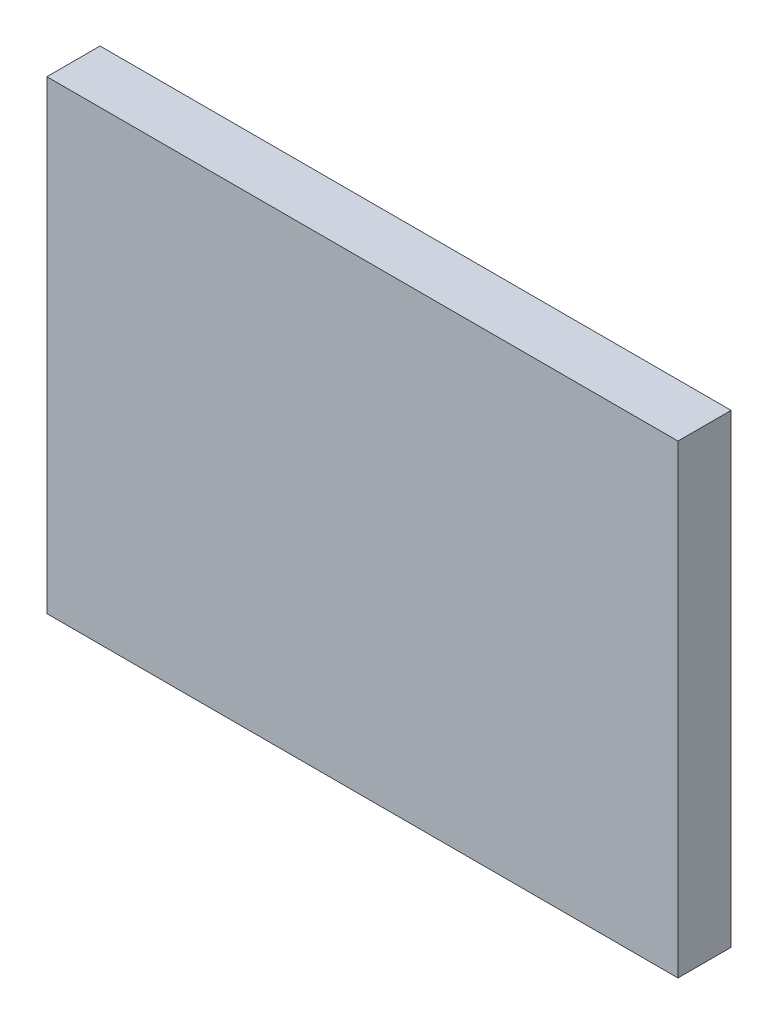
ISO-10303-21;
HEADER;
FILE_DESCRIPTION(('STEP AP214'),'2;1');
FILE_NAME('part.step','',(''),(''),'','','');
FILE_SCHEMA(('AUTOMOTIVE_DESIGN { 1 0 10303 214 1 1 1 1 }'));
ENDSEC;
DATA;
#1=APPLICATION_CONTEXT('core data for automotive mechanical design processes');
#2=APPLICATION_PROTOCOL_DEFINITION('international standard','automotive_design',2000,#1);
#3=PRODUCT_CONTEXT('',#1,'mechanical');
#4=PRODUCT('Part','Part','',(#3));
#5=PRODUCT_RELATED_PRODUCT_CATEGORY('part','',(#4));
#6=PRODUCT_DEFINITION_FORMATION('','',#4);
#7=PRODUCT_DEFINITION_CONTEXT('part definition',#1,'design');
#8=PRODUCT_DEFINITION('design','',#6,#7);
#9=PRODUCT_DEFINITION_SHAPE('','',#8);
#10=(LENGTH_UNIT() NAMED_UNIT(*) SI_UNIT(.MILLI.,.METRE.));
#11=(NAMED_UNIT(*) PLANE_ANGLE_UNIT() SI_UNIT($,.RADIAN.));
#12=(NAMED_UNIT(*) SI_UNIT($,.STERADIAN.) SOLID_ANGLE_UNIT());
#13=UNCERTAINTY_MEASURE_WITH_UNIT(LENGTH_MEASURE(1.E-05),#10,'distance_accuracy_value','');
#14=(GEOMETRIC_REPRESENTATION_CONTEXT(3) GLOBAL_UNCERTAINTY_ASSIGNED_CONTEXT((#13)) GLOBAL_UNIT_ASSIGNED_CONTEXT((#10,
#11,#12)) REPRESENTATION_CONTEXT('',''));
#15=CARTESIAN_POINT('',(0.,0.,0.));
#16=DIRECTION('',(0.,0.,1.));
#17=DIRECTION('',(1.,0.,0.));
#18=AXIS2_PLACEMENT_3D('',#15,#16,#17);
#19=CARTESIAN_POINT('',(-11.,-7.,1.6));
#20=DIRECTION('',(0.,0.,-1.));
#21=DIRECTION('',(-1.,0.,0.));
#22=AXIS2_PLACEMENT_3D('',#19,#20,#21);
#23=PLANE('',#22);
#24=DIRECTION('',(0.,1.,0.));
#25=VECTOR('',#24,1.);
#26=CARTESIAN_POINT('',(8.,-7.,1.6));
#27=LINE('',#26,#25);
#28=CARTESIAN_POINT('',(8.,-7.,1.6));
#29=VERTEX_POINT('',#28);
#30=CARTESIAN_POINT('',(8.,7.,1.6));
#31=VERTEX_POINT('',#30);
#32=EDGE_CURVE('E54',#29,#31,#27,.T.);
#33=ORIENTED_EDGE('',*,*,#32,.T.);
#34=DIRECTION('',(1.,0.,0.));
#35=VECTOR('',#34,1.);
#36=CARTESIAN_POINT('',(8.,7.,1.6));
#37=LINE('',#36,#35);
#38=CARTESIAN_POINT('',(-11.,7.,1.6));
#39=VERTEX_POINT('',#38);
#40=EDGE_CURVE('E56',#31,#39,#37,.F.);
#41=ORIENTED_EDGE('',*,*,#40,.T.);
#42=DIRECTION('',(0.,1.,0.));
#43=VECTOR('',#42,1.);
#44=CARTESIAN_POINT('',(-11.,7.,1.6));
#45=LINE('',#44,#43);
#46=CARTESIAN_POINT('',(-11.,-7.,1.6));
#47=VERTEX_POINT('',#46);
#48=EDGE_CURVE('E19',#39,#47,#45,.F.);
#49=ORIENTED_EDGE('',*,*,#48,.T.);
#50=DIRECTION('',(1.,0.,0.));
#51=VECTOR('',#50,1.);
#52=CARTESIAN_POINT('',(-11.,-7.,1.6));
#53=LINE('',#52,#51);
#54=EDGE_CURVE('E79',#47,#29,#53,.T.);
#55=ORIENTED_EDGE('',*,*,#54,.T.);
#56=EDGE_LOOP('',(#33,#41,#49,#55));
#57=FACE_BOUND('',#56,.T.);
#58=ADVANCED_FACE('F16',(#57),#23,.F.);
#59=CARTESIAN_POINT('',(-11.,7.,0.));
#60=DIRECTION('',(1.,0.,0.));
#61=DIRECTION('',(0.,0.,-1.));
#62=AXIS2_PLACEMENT_3D('',#59,#60,#61);
#63=PLANE('',#62);
#64=DIRECTION('',(0.,0.,1.));
#65=VECTOR('',#64,1.);
#66=CARTESIAN_POINT('',(-11.,-7.,0.));
#67=LINE('',#66,#65);
#68=CARTESIAN_POINT('',(-11.,-7.,0.));
#69=VERTEX_POINT('',#68);
#70=EDGE_CURVE('E67',#69,#47,#67,.T.);
#71=ORIENTED_EDGE('',*,*,#70,.T.);
#72=ORIENTED_EDGE('',*,*,#48,.F.);
#73=DIRECTION('',(0.,0.,-1.));
#74=VECTOR('',#73,1.);
#75=CARTESIAN_POINT('',(-11.,7.,0.));
#76=LINE('',#75,#74);
#77=CARTESIAN_POINT('',(-11.,7.,0.));
#78=VERTEX_POINT('',#77);
#79=EDGE_CURVE('E62',#39,#78,#76,.T.);
#80=ORIENTED_EDGE('',*,*,#79,.T.);
#81=DIRECTION('',(0.,1.,0.));
#82=VECTOR('',#81,1.);
#83=CARTESIAN_POINT('',(-11.,-7.,0.));
#84=LINE('',#83,#82);
#85=EDGE_CURVE('E82',#69,#78,#84,.T.);
#86=ORIENTED_EDGE('',*,*,#85,.F.);
#87=EDGE_LOOP('',(#71,#72,#80,#86));
#88=FACE_BOUND('',#87,.T.);
#89=ADVANCED_FACE('F64',(#88),#63,.F.);
#90=CARTESIAN_POINT('',(8.,7.,0.));
#91=DIRECTION('',(0.,-1.,0.));
#92=DIRECTION('',(0.,0.,-1.));
#93=AXIS2_PLACEMENT_3D('',#90,#91,#92);
#94=PLANE('',#93);
#95=ORIENTED_EDGE('',*,*,#79,.F.);
#96=ORIENTED_EDGE('',*,*,#40,.F.);
#97=DIRECTION('',(0.,0.,1.));
#98=VECTOR('',#97,1.);
#99=CARTESIAN_POINT('',(8.,7.,0.));
#100=LINE('',#99,#98);
#101=CARTESIAN_POINT('',(8.,7.,0.));
#102=VERTEX_POINT('',#101);
#103=EDGE_CURVE('E74',#31,#102,#100,.F.);
#104=ORIENTED_EDGE('',*,*,#103,.T.);
#105=DIRECTION('',(-1.,0.,0.));
#106=VECTOR('',#105,1.);
#107=CARTESIAN_POINT('',(-11.,7.,0.));
#108=LINE('',#107,#106);
#109=EDGE_CURVE('E71',#78,#102,#108,.F.);
#110=ORIENTED_EDGE('',*,*,#109,.F.);
#111=EDGE_LOOP('',(#95,#96,#104,#110));
#112=FACE_BOUND('',#111,.T.);
#113=ADVANCED_FACE('F69',(#112),#94,.F.);
#114=CARTESIAN_POINT('',(8.,-7.,0.));
#115=DIRECTION('',(-1.,0.,0.));
#116=DIRECTION('',(0.,0.,1.));
#117=AXIS2_PLACEMENT_3D('',#114,#115,#116);
#118=PLANE('',#117);
#119=ORIENTED_EDGE('',*,*,#103,.F.);
#120=ORIENTED_EDGE('',*,*,#32,.F.);
#121=DIRECTION('',(0.,0.,1.));
#122=VECTOR('',#121,1.);
#123=CARTESIAN_POINT('',(8.,-7.,0.));
#124=LINE('',#123,#122);
#125=CARTESIAN_POINT('',(8.,-7.,0.));
#126=VERTEX_POINT('',#125);
#127=EDGE_CURVE('E34',#29,#126,#124,.F.);
#128=ORIENTED_EDGE('',*,*,#127,.T.);
#129=DIRECTION('',(0.,1.,0.));
#130=VECTOR('',#129,1.);
#131=CARTESIAN_POINT('',(8.,-7.,0.));
#132=LINE('',#131,#130);
#133=EDGE_CURVE('E25',#102,#126,#132,.F.);
#134=ORIENTED_EDGE('',*,*,#133,.F.);
#135=EDGE_LOOP('',(#119,#120,#128,#134));
#136=FACE_BOUND('',#135,.T.);
#137=ADVANCED_FACE('F88',(#136),#118,.F.);
#138=CARTESIAN_POINT('',(-11.,-7.,0.));
#139=DIRECTION('',(0.,1.,0.));
#140=DIRECTION('',(0.,0.,1.));
#141=AXIS2_PLACEMENT_3D('',#138,#139,#140);
#142=PLANE('',#141);
#143=ORIENTED_EDGE('',*,*,#127,.F.);
#144=ORIENTED_EDGE('',*,*,#54,.F.);
#145=ORIENTED_EDGE('',*,*,#70,.F.);
#146=DIRECTION('',(-1.,0.,0.));
#147=VECTOR('',#146,1.);
#148=CARTESIAN_POINT('',(-11.,-7.,0.));
#149=LINE('',#148,#147);
#150=EDGE_CURVE('E10',#126,#69,#149,.T.);
#151=ORIENTED_EDGE('',*,*,#150,.F.);
#152=EDGE_LOOP('',(#143,#144,#145,#151));
#153=FACE_BOUND('',#152,.T.);
#154=ADVANCED_FACE('F90',(#153),#142,.F.);
#155=CARTESIAN_POINT('',(-11.,-7.,0.));
#156=DIRECTION('',(0.,0.,-1.));
#157=DIRECTION('',(-1.,0.,0.));
#158=AXIS2_PLACEMENT_3D('',#155,#156,#157);
#159=PLANE('',#158);
#160=ORIENTED_EDGE('',*,*,#133,.T.);
#161=ORIENTED_EDGE('',*,*,#150,.T.);
#162=ORIENTED_EDGE('',*,*,#85,.T.);
#163=ORIENTED_EDGE('',*,*,#109,.T.);
#164=EDGE_LOOP('',(#160,#161,#162,#163));
#165=FACE_BOUND('',#164,.T.);
#166=ADVANCED_FACE('F87',(#165),#159,.T.);
#167=CLOSED_SHELL('',(#58,#89,#113,#137,#154,#166));
#168=MANIFOLD_SOLID_BREP('B1',#167);
#169=ADVANCED_BREP_SHAPE_REPRESENTATION('',(#18,#168),#14);
#170=SHAPE_DEFINITION_REPRESENTATION(#9,#169);
ENDSEC;
END-ISO-10303-21;
